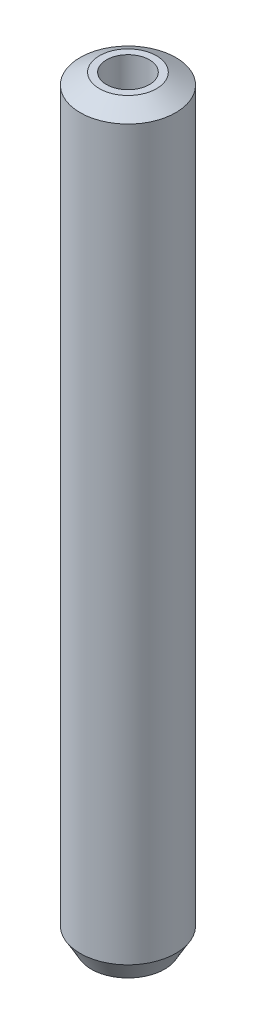
ISO-10303-21;
HEADER;
FILE_DESCRIPTION(('STEP AP214'),'2;1');
FILE_NAME('part.step','',(''),(''),'','','');
FILE_SCHEMA(('AUTOMOTIVE_DESIGN { 1 0 10303 214 1 1 1 1 }'));
ENDSEC;
DATA;
#1=APPLICATION_CONTEXT('core data for automotive mechanical design processes');
#2=APPLICATION_PROTOCOL_DEFINITION('international standard','automotive_design',2000,#1);
#3=PRODUCT_CONTEXT('',#1,'mechanical');
#4=PRODUCT('Part','Part','',(#3));
#5=PRODUCT_RELATED_PRODUCT_CATEGORY('part','',(#4));
#6=PRODUCT_DEFINITION_FORMATION('','',#4);
#7=PRODUCT_DEFINITION_CONTEXT('part definition',#1,'design');
#8=PRODUCT_DEFINITION('design','',#6,#7);
#9=PRODUCT_DEFINITION_SHAPE('','',#8);
#10=(LENGTH_UNIT() NAMED_UNIT(*) SI_UNIT(.MILLI.,.METRE.));
#11=(NAMED_UNIT(*) PLANE_ANGLE_UNIT() SI_UNIT($,.RADIAN.));
#12=(NAMED_UNIT(*) SI_UNIT($,.STERADIAN.) SOLID_ANGLE_UNIT());
#13=UNCERTAINTY_MEASURE_WITH_UNIT(LENGTH_MEASURE(1.E-05),#10,'distance_accuracy_value','');
#14=(GEOMETRIC_REPRESENTATION_CONTEXT(3) GLOBAL_UNCERTAINTY_ASSIGNED_CONTEXT((#13)) GLOBAL_UNIT_ASSIGNED_CONTEXT((#10,
#11,#12)) REPRESENTATION_CONTEXT('',''));
#15=CARTESIAN_POINT('',(0.,0.,0.));
#16=DIRECTION('',(0.,0.,1.));
#17=DIRECTION('',(1.,0.,0.));
#18=AXIS2_PLACEMENT_3D('',#15,#16,#17);
#19=CARTESIAN_POINT('',(0.,277.563198728765,0.));
#20=DIRECTION('',(0.,-1.,0.));
#21=DIRECTION('',(0.,0.,-1.));
#22=AXIS2_PLACEMENT_3D('',#19,#20,#21);
#23=CYLINDRICAL_SURFACE('',#22,17.5);
#24=CARTESIAN_POINT('',(0.,273.491197593751,0.));
#25=DIRECTION('',(0.,1.,0.));
#26=DIRECTION('',(0.,0.,1.));
#27=AXIS2_PLACEMENT_3D('',#24,#25,#26);
#28=CIRCLE('',#27,17.5);
#29=CARTESIAN_POINT('',(0.,273.491197593751,17.5));
#30=VERTEX_POINT('',#29);
#31=EDGE_CURVE('E50',#30,#30,#28,.F.);
#32=ORIENTED_EDGE('',*,*,#31,.T.);
#33=EDGE_LOOP('',(#32));
#34=FACE_BOUND('',#33,.T.);
#35=CARTESIAN_POINT('',(0.,7.05291285432236,0.));
#36=DIRECTION('',(0.,1.,0.));
#37=DIRECTION('',(0.,0.,1.));
#38=AXIS2_PLACEMENT_3D('',#35,#36,#37);
#39=CIRCLE('',#38,17.5);
#40=CARTESIAN_POINT('',(0.,7.05291285432236,17.5));
#41=VERTEX_POINT('',#40);
#42=EDGE_CURVE('E51',#41,#41,#39,.T.);
#43=ORIENTED_EDGE('',*,*,#42,.T.);
#44=EDGE_LOOP('',(#43));
#45=FACE_BOUND('',#44,.T.);
#46=ADVANCED_FACE('F39',(#34,#45),#23,.T.);
#47=CARTESIAN_POINT('',(0.,277.563198728765,0.));
#48=DIRECTION('',(0.,1.,0.));
#49=DIRECTION('',(0.,0.,1.));
#50=AXIS2_PLACEMENT_3D('',#47,#48,#49);
#51=PLANE('',#50);
#52=CARTESIAN_POINT('',(0.,277.563198728765,0.));
#53=DIRECTION('',(0.,1.,0.));
#54=DIRECTION('',(0.,0.,1.));
#55=AXIS2_PLACEMENT_3D('',#52,#53,#54);
#56=CIRCLE('',#55,10.4470871456778);
#57=CARTESIAN_POINT('',(0.,277.563198728765,10.4470871456778));
#58=VERTEX_POINT('',#57);
#59=EDGE_CURVE('E54',#58,#58,#56,.T.);
#60=ORIENTED_EDGE('',*,*,#59,.T.);
#61=EDGE_LOOP('',(#60));
#62=FACE_BOUND('',#61,.T.);
#63=CARTESIAN_POINT('',(0.,277.563198728765,0.));
#64=DIRECTION('',(0.,1.,0.));
#65=DIRECTION('',(0.,0.,1.));
#66=AXIS2_PLACEMENT_3D('',#63,#64,#65);
#67=CIRCLE('',#66,7.86010785919868);
#68=CARTESIAN_POINT('',(0.,277.563198728765,7.86010785919868));
#69=VERTEX_POINT('',#68);
#70=EDGE_CURVE('E58',#69,#69,#67,.T.);
#71=ORIENTED_EDGE('',*,*,#70,.F.);
#72=EDGE_LOOP('',(#71));
#73=FACE_BOUND('',#72,.T.);
#74=ADVANCED_FACE('F69',(#62,#73),#51,.T.);
#75=CARTESIAN_POINT('',(0.,0.,0.));
#76=DIRECTION('',(0.,1.,0.));
#77=DIRECTION('',(0.,0.,1.));
#78=AXIS2_PLACEMENT_3D('',#75,#76,#77);
#79=PLANE('',#78);
#80=CARTESIAN_POINT('',(0.,0.,0.));
#81=DIRECTION('',(0.,1.,0.));
#82=DIRECTION('',(0.,0.,1.));
#83=AXIS2_PLACEMENT_3D('',#80,#81,#82);
#84=CIRCLE('',#83,13.427998864986);
#85=CARTESIAN_POINT('',(0.,0.,13.427998864986));
#86=VERTEX_POINT('',#85);
#87=EDGE_CURVE('E10',#86,#86,#84,.F.);
#88=ORIENTED_EDGE('',*,*,#87,.T.);
#89=EDGE_LOOP('',(#88));
#90=FACE_BOUND('',#89,.T.);
#91=CARTESIAN_POINT('',(0.,0.,0.));
#92=DIRECTION('',(0.,1.,0.));
#93=DIRECTION('',(0.,0.,1.));
#94=AXIS2_PLACEMENT_3D('',#91,#92,#93);
#95=CIRCLE('',#94,7.86010785919868);
#96=CARTESIAN_POINT('',(0.,0.,7.86010785919868));
#97=VERTEX_POINT('',#96);
#98=EDGE_CURVE('E63',#97,#97,#95,.T.);
#99=ORIENTED_EDGE('',*,*,#98,.T.);
#100=EDGE_LOOP('',(#99));
#101=FACE_BOUND('',#100,.T.);
#102=ADVANCED_FACE('F75',(#90,#101),#79,.F.);
#103=CARTESIAN_POINT('',(0.,277.563198728765,0.));
#104=DIRECTION('',(0.,-1.,0.));
#105=DIRECTION('',(0.,0.,-1.));
#106=AXIS2_PLACEMENT_3D('',#103,#104,#105);
#107=CYLINDRICAL_SURFACE('',#106,7.86010785919868);
#108=ORIENTED_EDGE('',*,*,#70,.T.);
#109=EDGE_LOOP('',(#108));
#110=FACE_BOUND('',#109,.T.);
#111=ORIENTED_EDGE('',*,*,#98,.F.);
#112=EDGE_LOOP('',(#111));
#113=FACE_BOUND('',#112,.T.);
#114=ADVANCED_FACE('F70',(#110,#113),#107,.F.);
#115=CARTESIAN_POINT('',(0.,277.563198728765,0.));
#116=DIRECTION('',(0.,-1.,0.));
#117=DIRECTION('',(0.,0.,-1.));
#118=AXIS2_PLACEMENT_3D('',#115,#116,#117);
#119=CONICAL_SURFACE('',#118,10.4470871456778,1.0471975511966);
#120=ORIENTED_EDGE('',*,*,#31,.F.);
#121=EDGE_LOOP('',(#120));
#122=FACE_BOUND('',#121,.T.);
#123=ORIENTED_EDGE('',*,*,#59,.F.);
#124=EDGE_LOOP('',(#123));
#125=FACE_BOUND('',#124,.T.);
#126=ADVANCED_FACE('F81',(#122,#125),#119,.T.);
#127=CARTESIAN_POINT('',(0.,7.05291285432236,0.));
#128=DIRECTION('',(0.,1.,0.));
#129=DIRECTION('',(0.,0.,1.));
#130=AXIS2_PLACEMENT_3D('',#127,#128,#129);
#131=CONICAL_SURFACE('',#130,17.5,0.523598775598304);
#132=ORIENTED_EDGE('',*,*,#87,.F.);
#133=EDGE_LOOP('',(#132));
#134=FACE_BOUND('',#133,.T.);
#135=ORIENTED_EDGE('',*,*,#42,.F.);
#136=EDGE_LOOP('',(#135));
#137=FACE_BOUND('',#136,.T.);
#138=ADVANCED_FACE('F45',(#134,#137),#131,.T.);
#139=CLOSED_SHELL('',(#46,#74,#102,#114,#126,#138));
#140=MANIFOLD_SOLID_BREP('B2',#139);
#141=ADVANCED_BREP_SHAPE_REPRESENTATION('',(#18,#140),#14);
#142=SHAPE_DEFINITION_REPRESENTATION(#9,#141);
ENDSEC;
END-ISO-10303-21;
